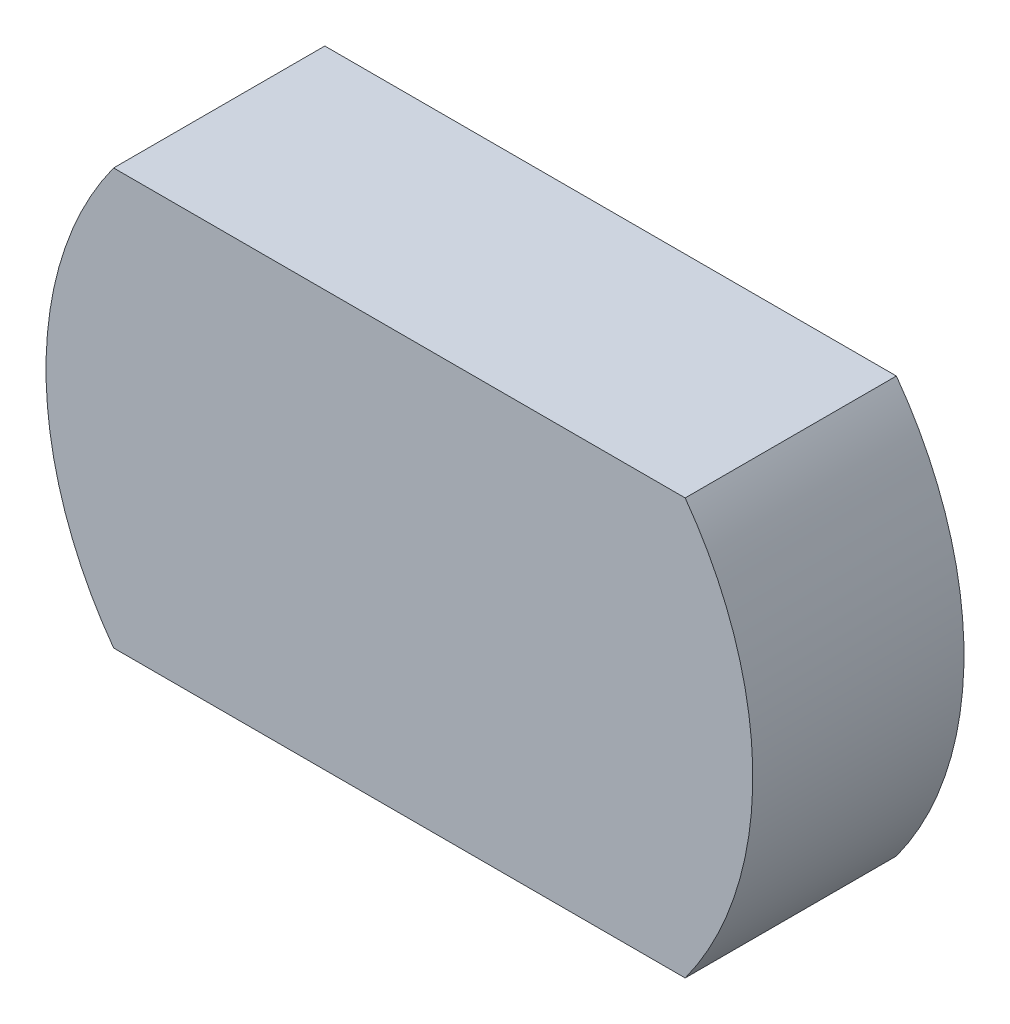
ISO-10303-21;
HEADER;
FILE_DESCRIPTION(('STEP AP214'),'2;1');
FILE_NAME('part.step','',(''),(''),'','','');
FILE_SCHEMA(('AUTOMOTIVE_DESIGN { 1 0 10303 214 1 1 1 1 }'));
ENDSEC;
DATA;
#1=APPLICATION_CONTEXT('core data for automotive mechanical design processes');
#2=APPLICATION_PROTOCOL_DEFINITION('international standard','automotive_design',2000,#1);
#3=PRODUCT_CONTEXT('',#1,'mechanical');
#4=PRODUCT('Part','Part','',(#3));
#5=PRODUCT_RELATED_PRODUCT_CATEGORY('part','',(#4));
#6=PRODUCT_DEFINITION_FORMATION('','',#4);
#7=PRODUCT_DEFINITION_CONTEXT('part definition',#1,'design');
#8=PRODUCT_DEFINITION('design','',#6,#7);
#9=PRODUCT_DEFINITION_SHAPE('','',#8);
#10=(LENGTH_UNIT() NAMED_UNIT(*) SI_UNIT(.MILLI.,.METRE.));
#11=(NAMED_UNIT(*) PLANE_ANGLE_UNIT() SI_UNIT($,.RADIAN.));
#12=(NAMED_UNIT(*) SI_UNIT($,.STERADIAN.) SOLID_ANGLE_UNIT());
#13=UNCERTAINTY_MEASURE_WITH_UNIT(LENGTH_MEASURE(1.E-05),#10,'distance_accuracy_value','');
#14=(GEOMETRIC_REPRESENTATION_CONTEXT(3) GLOBAL_UNCERTAINTY_ASSIGNED_CONTEXT((#13)) GLOBAL_UNIT_ASSIGNED_CONTEXT((#10,
#11,#12)) REPRESENTATION_CONTEXT('',''));
#15=CARTESIAN_POINT('',(0.,0.,0.));
#16=DIRECTION('',(0.,0.,1.));
#17=DIRECTION('',(1.,0.,0.));
#18=AXIS2_PLACEMENT_3D('',#15,#16,#17);
#19=CARTESIAN_POINT('',(0.,0.,25.4));
#20=DIRECTION('',(0.,0.,-1.));
#21=DIRECTION('',(-1.,0.,0.));
#22=AXIS2_PLACEMENT_3D('',#19,#20,#21);
#23=CYLINDRICAL_SURFACE('',#22,42.5);
#24=CARTESIAN_POINT('',(0.,0.,0.));
#25=DIRECTION('',(0.,0.,1.));
#26=DIRECTION('',(1.,0.,0.));
#27=AXIS2_PLACEMENT_3D('',#24,#25,#26);
#28=CIRCLE('',#27,42.5);
#29=CARTESIAN_POINT('',(34.3693177121688,-25.,0.));
#30=VERTEX_POINT('',#29);
#31=CARTESIAN_POINT('',(34.3693177121688,25.,0.));
#32=VERTEX_POINT('',#31);
#33=EDGE_CURVE('E95',#30,#32,#28,.T.);
#34=ORIENTED_EDGE('',*,*,#33,.T.);
#35=DIRECTION('',(0.,0.,-1.));
#36=VECTOR('',#35,1.);
#37=CARTESIAN_POINT('',(34.3693177121688,25.,25.4));
#38=LINE('',#37,#36);
#39=CARTESIAN_POINT('',(34.3693177121688,25.,25.4));
#40=VERTEX_POINT('',#39);
#41=EDGE_CURVE('E11',#40,#32,#38,.T.);
#42=ORIENTED_EDGE('',*,*,#41,.F.);
#43=CARTESIAN_POINT('',(0.,0.,25.4));
#44=DIRECTION('',(0.,0.,1.));
#45=DIRECTION('',(1.,0.,0.));
#46=AXIS2_PLACEMENT_3D('',#43,#44,#45);
#47=CIRCLE('',#46,42.5);
#48=CARTESIAN_POINT('',(34.3693177121688,-25.,25.4));
#49=VERTEX_POINT('',#48);
#50=EDGE_CURVE('E83',#49,#40,#47,.T.);
#51=ORIENTED_EDGE('',*,*,#50,.F.);
#52=DIRECTION('',(0.,0.,-1.));
#53=VECTOR('',#52,1.);
#54=CARTESIAN_POINT('',(34.3693177121688,-25.,25.4));
#55=LINE('',#54,#53);
#56=EDGE_CURVE('E91',#49,#30,#55,.T.);
#57=ORIENTED_EDGE('',*,*,#56,.T.);
#58=EDGE_LOOP('',(#34,#42,#51,#57));
#59=FACE_BOUND('',#58,.T.);
#60=ADVANCED_FACE('F32',(#59),#23,.T.);
#61=CARTESIAN_POINT('',(-34.3693177121688,25.,25.4));
#62=DIRECTION('',(0.,-1.,0.));
#63=DIRECTION('',(0.,0.,-1.));
#64=AXIS2_PLACEMENT_3D('',#61,#62,#63);
#65=PLANE('',#64);
#66=DIRECTION('',(-1.,0.,0.));
#67=VECTOR('',#66,1.);
#68=CARTESIAN_POINT('',(-34.3693177121688,25.,0.));
#69=LINE('',#68,#67);
#70=CARTESIAN_POINT('',(-34.3693177121688,25.,0.));
#71=VERTEX_POINT('',#70);
#72=EDGE_CURVE('E87',#32,#71,#69,.T.);
#73=ORIENTED_EDGE('',*,*,#72,.T.);
#74=DIRECTION('',(0.,0.,-1.));
#75=VECTOR('',#74,1.);
#76=CARTESIAN_POINT('',(-34.3693177121688,25.,25.4));
#77=LINE('',#76,#75);
#78=CARTESIAN_POINT('',(-34.3693177121688,25.,25.4));
#79=VERTEX_POINT('',#78);
#80=EDGE_CURVE('E40',#79,#71,#77,.T.);
#81=ORIENTED_EDGE('',*,*,#80,.F.);
#82=DIRECTION('',(-1.,0.,0.));
#83=VECTOR('',#82,1.);
#84=CARTESIAN_POINT('',(-34.3693177121688,25.,25.4));
#85=LINE('',#84,#83);
#86=EDGE_CURVE('E78',#40,#79,#85,.T.);
#87=ORIENTED_EDGE('',*,*,#86,.F.);
#88=ORIENTED_EDGE('',*,*,#41,.T.);
#89=EDGE_LOOP('',(#73,#81,#87,#88));
#90=FACE_BOUND('',#89,.T.);
#91=ADVANCED_FACE('F86',(#90),#65,.F.);
#92=CARTESIAN_POINT('',(0.,0.,25.4));
#93=DIRECTION('',(0.,0.,-1.));
#94=DIRECTION('',(-1.,0.,0.));
#95=AXIS2_PLACEMENT_3D('',#92,#93,#94);
#96=CYLINDRICAL_SURFACE('',#95,42.5);
#97=CARTESIAN_POINT('',(0.,0.,0.));
#98=DIRECTION('',(0.,0.,1.));
#99=DIRECTION('',(1.,0.,0.));
#100=AXIS2_PLACEMENT_3D('',#97,#98,#99);
#101=CIRCLE('',#100,42.5);
#102=CARTESIAN_POINT('',(-34.3693177121688,-25.,0.));
#103=VERTEX_POINT('',#102);
#104=EDGE_CURVE('E65',#71,#103,#101,.T.);
#105=ORIENTED_EDGE('',*,*,#104,.T.);
#106=DIRECTION('',(0.,0.,-1.));
#107=VECTOR('',#106,1.);
#108=CARTESIAN_POINT('',(-34.3693177121688,-25.,25.4));
#109=LINE('',#108,#107);
#110=CARTESIAN_POINT('',(-34.3693177121688,-25.,25.4));
#111=VERTEX_POINT('',#110);
#112=EDGE_CURVE('E88',#111,#103,#109,.T.);
#113=ORIENTED_EDGE('',*,*,#112,.F.);
#114=CARTESIAN_POINT('',(0.,0.,25.4));
#115=DIRECTION('',(0.,0.,1.));
#116=DIRECTION('',(1.,0.,0.));
#117=AXIS2_PLACEMENT_3D('',#114,#115,#116);
#118=CIRCLE('',#117,42.5);
#119=EDGE_CURVE('E81',#79,#111,#118,.T.);
#120=ORIENTED_EDGE('',*,*,#119,.F.);
#121=ORIENTED_EDGE('',*,*,#80,.T.);
#122=EDGE_LOOP('',(#105,#113,#120,#121));
#123=FACE_BOUND('',#122,.T.);
#124=ADVANCED_FACE('F89',(#123),#96,.T.);
#125=CARTESIAN_POINT('',(-34.3693177121688,-25.,25.4));
#126=DIRECTION('',(0.,1.,0.));
#127=DIRECTION('',(0.,0.,1.));
#128=AXIS2_PLACEMENT_3D('',#125,#126,#127);
#129=PLANE('',#128);
#130=DIRECTION('',(1.,0.,0.));
#131=VECTOR('',#130,1.);
#132=CARTESIAN_POINT('',(-34.3693177121688,-25.,0.));
#133=LINE('',#132,#131);
#134=EDGE_CURVE('E71',#103,#30,#133,.T.);
#135=ORIENTED_EDGE('',*,*,#134,.T.);
#136=ORIENTED_EDGE('',*,*,#56,.F.);
#137=DIRECTION('',(1.,0.,0.));
#138=VECTOR('',#137,1.);
#139=CARTESIAN_POINT('',(-34.3693177121688,-25.,25.4));
#140=LINE('',#139,#138);
#141=EDGE_CURVE('E48',#111,#49,#140,.T.);
#142=ORIENTED_EDGE('',*,*,#141,.F.);
#143=ORIENTED_EDGE('',*,*,#112,.T.);
#144=EDGE_LOOP('',(#135,#136,#142,#143));
#145=FACE_BOUND('',#144,.T.);
#146=ADVANCED_FACE('F102',(#145),#129,.F.);
#147=CARTESIAN_POINT('',(0.,0.,25.4));
#148=DIRECTION('',(0.,0.,1.));
#149=DIRECTION('',(1.,0.,0.));
#150=AXIS2_PLACEMENT_3D('',#147,#148,#149);
#151=PLANE('',#150);
#152=ORIENTED_EDGE('',*,*,#50,.T.);
#153=ORIENTED_EDGE('',*,*,#86,.T.);
#154=ORIENTED_EDGE('',*,*,#119,.T.);
#155=ORIENTED_EDGE('',*,*,#141,.T.);
#156=EDGE_LOOP('',(#152,#153,#154,#155));
#157=FACE_BOUND('',#156,.T.);
#158=ADVANCED_FACE('F79',(#157),#151,.T.);
#159=CARTESIAN_POINT('',(0.,0.,0.));
#160=DIRECTION('',(0.,0.,1.));
#161=DIRECTION('',(1.,0.,0.));
#162=AXIS2_PLACEMENT_3D('',#159,#160,#161);
#163=PLANE('',#162);
#164=ORIENTED_EDGE('',*,*,#33,.F.);
#165=ORIENTED_EDGE('',*,*,#134,.F.);
#166=ORIENTED_EDGE('',*,*,#104,.F.);
#167=ORIENTED_EDGE('',*,*,#72,.F.);
#168=EDGE_LOOP('',(#164,#165,#166,#167));
#169=FACE_BOUND('',#168,.T.);
#170=ADVANCED_FACE('F105',(#169),#163,.F.);
#171=CLOSED_SHELL('',(#60,#91,#124,#146,#158,#170));
#172=MANIFOLD_SOLID_BREP('B2',#171);
#173=ADVANCED_BREP_SHAPE_REPRESENTATION('',(#18,#172),#14);
#174=SHAPE_DEFINITION_REPRESENTATION(#9,#173);
ENDSEC;
END-ISO-10303-21;
